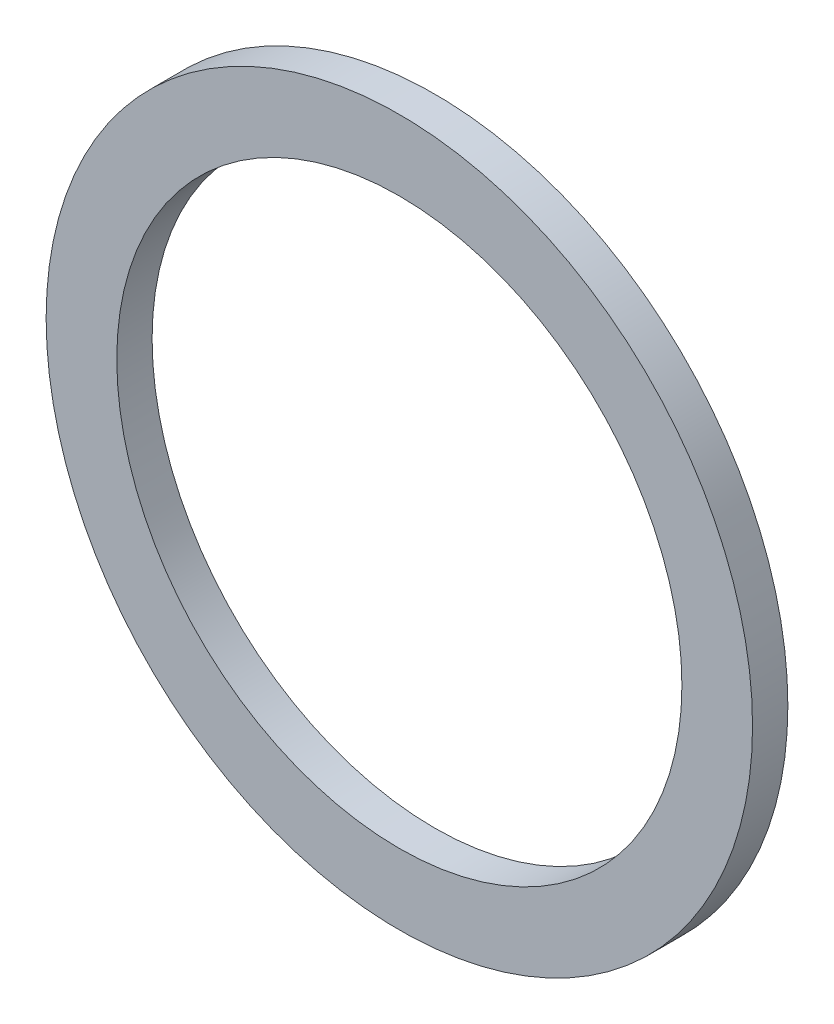
ISO-10303-21;
HEADER;
FILE_DESCRIPTION(('STEP AP214'),'2;1');
FILE_NAME('part.step','',(''),(''),'','','');
FILE_SCHEMA(('AUTOMOTIVE_DESIGN { 1 0 10303 214 1 1 1 1 }'));
ENDSEC;
DATA;
#1=APPLICATION_CONTEXT('core data for automotive mechanical design processes');
#2=APPLICATION_PROTOCOL_DEFINITION('international standard','automotive_design',2000,#1);
#3=PRODUCT_CONTEXT('',#1,'mechanical');
#4=PRODUCT('Part','Part','',(#3));
#5=PRODUCT_RELATED_PRODUCT_CATEGORY('part','',(#4));
#6=PRODUCT_DEFINITION_FORMATION('','',#4);
#7=PRODUCT_DEFINITION_CONTEXT('part definition',#1,'design');
#8=PRODUCT_DEFINITION('design','',#6,#7);
#9=PRODUCT_DEFINITION_SHAPE('','',#8);
#10=(LENGTH_UNIT() NAMED_UNIT(*) SI_UNIT(.MILLI.,.METRE.));
#11=(NAMED_UNIT(*) PLANE_ANGLE_UNIT() SI_UNIT($,.RADIAN.));
#12=(NAMED_UNIT(*) SI_UNIT($,.STERADIAN.) SOLID_ANGLE_UNIT());
#13=UNCERTAINTY_MEASURE_WITH_UNIT(LENGTH_MEASURE(1.E-05),#10,'distance_accuracy_value','');
#14=(GEOMETRIC_REPRESENTATION_CONTEXT(3) GLOBAL_UNCERTAINTY_ASSIGNED_CONTEXT((#13)) GLOBAL_UNIT_ASSIGNED_CONTEXT((#10,
#11,#12)) REPRESENTATION_CONTEXT('',''));
#15=CARTESIAN_POINT('',(0.,0.,0.));
#16=DIRECTION('',(0.,0.,1.));
#17=DIRECTION('',(1.,0.,0.));
#18=AXIS2_PLACEMENT_3D('',#15,#16,#17);
#19=CARTESIAN_POINT('',(8.00000011920929,-4.33333336313566,2.));
#20=DIRECTION('',(0.,0.,-1.));
#21=DIRECTION('',(0.,-1.,0.));
#22=AXIS2_PLACEMENT_3D('',#19,#20,#21);
#23=PLANE('',#22);
#24=CARTESIAN_POINT('',(8.00000011920929,-4.33333336313566,2.));
#25=DIRECTION('',(0.,0.,1.));
#26=DIRECTION('',(1.,0.,0.));
#27=AXIS2_PLACEMENT_3D('',#24,#25,#26);
#28=CIRCLE('',#27,0.800000014901161);
#29=CARTESIAN_POINT('',(7.20000010430813,-4.33333336313566,2.));
#30=VERTEX_POINT('',#29);
#31=EDGE_CURVE('E59',#30,#30,#28,.T.);
#32=ORIENTED_EDGE('',*,*,#31,.T.);
#33=EDGE_LOOP('',(#32));
#34=FACE_BOUND('',#33,.T.);
#35=CARTESIAN_POINT('',(8.00000011920929,-4.33333336313566,2.));
#36=DIRECTION('',(0.,0.,-1.));
#37=DIRECTION('',(1.,0.,0.));
#38=AXIS2_PLACEMENT_3D('',#35,#36,#37);
#39=CIRCLE('',#38,1.00000001490116);
#40=CARTESIAN_POINT('',(7.00000010430813,-4.33333336313566,2.));
#41=VERTEX_POINT('',#40);
#42=EDGE_CURVE('E11',#41,#41,#39,.T.);
#43=ORIENTED_EDGE('',*,*,#42,.T.);
#44=EDGE_LOOP('',(#43));
#45=FACE_BOUND('',#44,.T.);
#46=ADVANCED_FACE('F17',(#34,#45),#23,.T.);
#47=CARTESIAN_POINT('',(8.00000011920929,-4.33333336313566,2.1));
#48=DIRECTION('',(0.,0.,-1.));
#49=DIRECTION('',(0.,-1.,0.));
#50=AXIS2_PLACEMENT_3D('',#47,#48,#49);
#51=PLANE('',#50);
#52=CARTESIAN_POINT('',(8.00000011920929,-4.33333336313566,2.1));
#53=DIRECTION('',(0.,0.,1.));
#54=DIRECTION('',(1.,0.,0.));
#55=AXIS2_PLACEMENT_3D('',#52,#53,#54);
#56=CIRCLE('',#55,0.800000014901161);
#57=CARTESIAN_POINT('',(7.20000010430813,-4.33333336313566,2.1));
#58=VERTEX_POINT('',#57);
#59=EDGE_CURVE('E58',#58,#58,#56,.T.);
#60=ORIENTED_EDGE('',*,*,#59,.F.);
#61=EDGE_LOOP('',(#60));
#62=FACE_BOUND('',#61,.T.);
#63=CARTESIAN_POINT('',(8.00000011920929,-4.33333336313566,2.1));
#64=DIRECTION('',(0.,0.,-1.));
#65=DIRECTION('',(1.,0.,0.));
#66=AXIS2_PLACEMENT_3D('',#63,#64,#65);
#67=CIRCLE('',#66,1.00000001490116);
#68=CARTESIAN_POINT('',(7.00000010430813,-4.33333336313566,2.1));
#69=VERTEX_POINT('',#68);
#70=EDGE_CURVE('E65',#69,#69,#67,.T.);
#71=ORIENTED_EDGE('',*,*,#70,.F.);
#72=EDGE_LOOP('',(#71));
#73=FACE_BOUND('',#72,.T.);
#74=ADVANCED_FACE('F19',(#62,#73),#51,.F.);
#75=CARTESIAN_POINT('',(8.00000011920929,-4.33333336313566,2.));
#76=DIRECTION('',(0.,0.,-1.));
#77=DIRECTION('',(1.,0.,0.));
#78=AXIS2_PLACEMENT_3D('',#75,#76,#77);
#79=CYLINDRICAL_SURFACE('',#78,1.00000001490116);
#80=ORIENTED_EDGE('',*,*,#70,.T.);
#81=DIRECTION('',(0.,0.,-1.));
#82=VECTOR('',#81,1.);
#83=CARTESIAN_POINT('',(7.00000010430813,-4.33333336313566,2.));
#84=LINE('',#83,#82);
#85=EDGE_CURVE('E21',#69,#41,#84,.T.);
#86=ORIENTED_EDGE('',*,*,#85,.T.);
#87=ORIENTED_EDGE('',*,*,#42,.F.);
#88=ORIENTED_EDGE('',*,*,#85,.F.);
#89=EDGE_LOOP('',(#80,#86,#87,#88));
#90=FACE_BOUND('',#89,.T.);
#91=ADVANCED_FACE('F74',(#90),#79,.T.);
#92=CARTESIAN_POINT('',(8.00000011920929,-4.33333336313566,2.));
#93=DIRECTION('',(0.,0.,-1.));
#94=DIRECTION('',(1.,0.,0.));
#95=AXIS2_PLACEMENT_3D('',#92,#93,#94);
#96=CYLINDRICAL_SURFACE('',#95,0.800000014901161);
#97=ORIENTED_EDGE('',*,*,#59,.T.);
#98=DIRECTION('',(0.,0.,-1.));
#99=VECTOR('',#98,1.);
#100=CARTESIAN_POINT('',(7.20000010430813,-4.33333336313566,2.));
#101=LINE('',#100,#99);
#102=EDGE_CURVE('E55',#58,#30,#101,.T.);
#103=ORIENTED_EDGE('',*,*,#102,.T.);
#104=ORIENTED_EDGE('',*,*,#31,.F.);
#105=ORIENTED_EDGE('',*,*,#102,.F.);
#106=EDGE_LOOP('',(#97,#103,#104,#105));
#107=FACE_BOUND('',#106,.T.);
#108=ADVANCED_FACE('F56',(#107),#96,.F.);
#109=CLOSED_SHELL('',(#46,#74,#91,#108));
#110=MANIFOLD_SOLID_BREP('B1',#109);
#111=ADVANCED_BREP_SHAPE_REPRESENTATION('',(#18,#110),#14);
#112=SHAPE_DEFINITION_REPRESENTATION(#9,#111);
ENDSEC;
END-ISO-10303-21;
